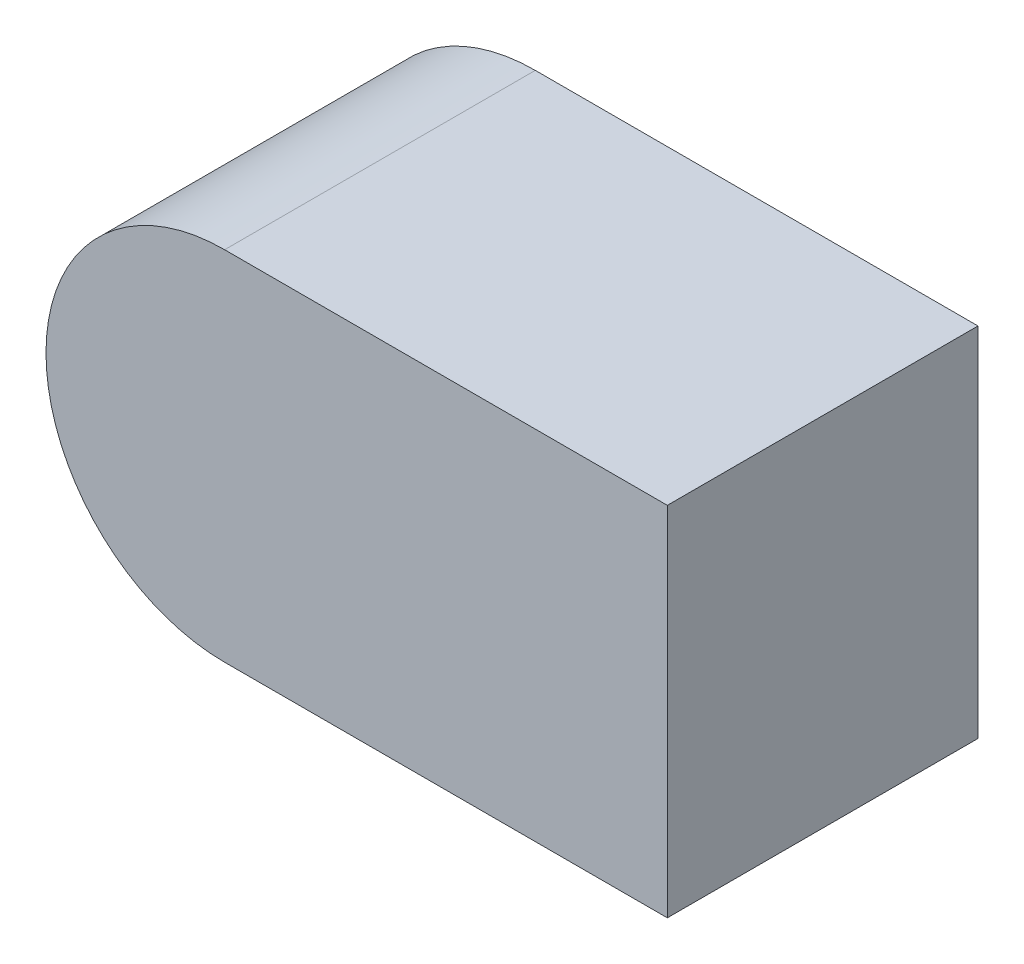
ISO-10303-21;
HEADER;
FILE_DESCRIPTION(('STEP AP214'),'2;1');
FILE_NAME('part.step','',(''),(''),'','','');
FILE_SCHEMA(('AUTOMOTIVE_DESIGN { 1 0 10303 214 1 1 1 1 }'));
ENDSEC;
DATA;
#1=APPLICATION_CONTEXT('core data for automotive mechanical design processes');
#2=APPLICATION_PROTOCOL_DEFINITION('international standard','automotive_design',2000,#1);
#3=PRODUCT_CONTEXT('',#1,'mechanical');
#4=PRODUCT('Part','Part','',(#3));
#5=PRODUCT_RELATED_PRODUCT_CATEGORY('part','',(#4));
#6=PRODUCT_DEFINITION_FORMATION('','',#4);
#7=PRODUCT_DEFINITION_CONTEXT('part definition',#1,'design');
#8=PRODUCT_DEFINITION('design','',#6,#7);
#9=PRODUCT_DEFINITION_SHAPE('','',#8);
#10=(LENGTH_UNIT() NAMED_UNIT(*) SI_UNIT(.MILLI.,.METRE.));
#11=(NAMED_UNIT(*) PLANE_ANGLE_UNIT() SI_UNIT($,.RADIAN.));
#12=(NAMED_UNIT(*) SI_UNIT($,.STERADIAN.) SOLID_ANGLE_UNIT());
#13=UNCERTAINTY_MEASURE_WITH_UNIT(LENGTH_MEASURE(1.E-05),#10,'distance_accuracy_value','');
#14=(GEOMETRIC_REPRESENTATION_CONTEXT(3) GLOBAL_UNCERTAINTY_ASSIGNED_CONTEXT((#13)) GLOBAL_UNIT_ASSIGNED_CONTEXT((#10,
#11,#12)) REPRESENTATION_CONTEXT('',''));
#15=CARTESIAN_POINT('',(0.,0.,0.));
#16=DIRECTION('',(0.,0.,1.));
#17=DIRECTION('',(1.,0.,0.));
#18=AXIS2_PLACEMENT_3D('',#15,#16,#17);
#19=CARTESIAN_POINT('',(2.8335265642716,1.75,0.));
#20=DIRECTION('',(0.,0.,1.));
#21=DIRECTION('',(-1.,0.,0.));
#22=AXIS2_PLACEMENT_3D('',#19,#20,#21);
#23=PLANE('',#22);
#24=DIRECTION('',(0.,1.,0.));
#25=VECTOR('',#24,1.);
#26=CARTESIAN_POINT('',(3.,1.635,0.));
#27=LINE('',#26,#25);
#28=CARTESIAN_POINT('',(3.,1.635,0.));
#29=VERTEX_POINT('',#28);
#30=CARTESIAN_POINT('',(3.,1.865,0.));
#31=VERTEX_POINT('',#30);
#32=EDGE_CURVE('E11',#29,#31,#27,.T.);
#33=ORIENTED_EDGE('',*,*,#32,.F.);
#34=DIRECTION('',(1.,0.,0.));
#35=VECTOR('',#34,1.);
#36=CARTESIAN_POINT('',(2.715,1.635,0.));
#37=LINE('',#36,#35);
#38=CARTESIAN_POINT('',(2.715,1.635,0.));
#39=VERTEX_POINT('',#38);
#40=EDGE_CURVE('E24',#39,#29,#37,.T.);
#41=ORIENTED_EDGE('',*,*,#40,.F.);
#42=CARTESIAN_POINT('',(2.715,1.75,0.));
#43=DIRECTION('',(0.,0.,1.));
#44=DIRECTION('',(0.,1.,0.));
#45=AXIS2_PLACEMENT_3D('',#42,#43,#44);
#46=CIRCLE('',#45,0.115);
#47=CARTESIAN_POINT('',(2.715,1.865,0.));
#48=VERTEX_POINT('',#47);
#49=EDGE_CURVE('E85',#48,#39,#46,.T.);
#50=ORIENTED_EDGE('',*,*,#49,.F.);
#51=DIRECTION('',(-1.,0.,0.));
#52=VECTOR('',#51,1.);
#53=CARTESIAN_POINT('',(3.,1.865,0.));
#54=LINE('',#53,#52);
#55=EDGE_CURVE('E82',#31,#48,#54,.T.);
#56=ORIENTED_EDGE('',*,*,#55,.F.);
#57=EDGE_LOOP('',(#33,#41,#50,#56));
#58=FACE_BOUND('',#57,.T.);
#59=ADVANCED_FACE('F17',(#58),#23,.F.);
#60=CARTESIAN_POINT('',(3.,1.865,0.));
#61=DIRECTION('',(0.,1.,0.));
#62=DIRECTION('',(-1.,0.,0.));
#63=AXIS2_PLACEMENT_3D('',#60,#61,#62);
#64=PLANE('',#63);
#65=ORIENTED_EDGE('',*,*,#55,.T.);
#66=DIRECTION('',(0.,0.,1.));
#67=VECTOR('',#66,1.);
#68=CARTESIAN_POINT('',(2.715,1.865,0.));
#69=LINE('',#68,#67);
#70=CARTESIAN_POINT('',(2.715,1.865,0.2));
#71=VERTEX_POINT('',#70);
#72=EDGE_CURVE('E80',#48,#71,#69,.T.);
#73=ORIENTED_EDGE('',*,*,#72,.T.);
#74=DIRECTION('',(-1.,0.,0.));
#75=VECTOR('',#74,1.);
#76=CARTESIAN_POINT('',(3.,1.865,0.2));
#77=LINE('',#76,#75);
#78=CARTESIAN_POINT('',(3.,1.865,0.2));
#79=VERTEX_POINT('',#78);
#80=EDGE_CURVE('E78',#79,#71,#77,.T.);
#81=ORIENTED_EDGE('',*,*,#80,.F.);
#82=DIRECTION('',(0.,0.,-1.));
#83=VECTOR('',#82,1.);
#84=CARTESIAN_POINT('',(3.,1.865,0.));
#85=LINE('',#84,#83);
#86=EDGE_CURVE('E71',#79,#31,#85,.T.);
#87=ORIENTED_EDGE('',*,*,#86,.T.);
#88=EDGE_LOOP('',(#65,#73,#81,#87));
#89=FACE_BOUND('',#88,.T.);
#90=ADVANCED_FACE('F91',(#89),#64,.T.);
#91=CARTESIAN_POINT('',(2.715,1.75,0.));
#92=DIRECTION('',(0.,0.,1.));
#93=DIRECTION('',(0.,1.,0.));
#94=AXIS2_PLACEMENT_3D('',#91,#92,#93);
#95=CYLINDRICAL_SURFACE('',#94,0.115);
#96=ORIENTED_EDGE('',*,*,#49,.T.);
#97=DIRECTION('',(0.,0.,1.));
#98=VECTOR('',#97,1.);
#99=CARTESIAN_POINT('',(2.715,1.635,0.));
#100=LINE('',#99,#98);
#101=CARTESIAN_POINT('',(2.715,1.635,0.2));
#102=VERTEX_POINT('',#101);
#103=EDGE_CURVE('E75',#39,#102,#100,.T.);
#104=ORIENTED_EDGE('',*,*,#103,.T.);
#105=CARTESIAN_POINT('',(2.715,1.75,0.2));
#106=DIRECTION('',(0.,0.,1.));
#107=DIRECTION('',(0.,1.,0.));
#108=AXIS2_PLACEMENT_3D('',#105,#106,#107);
#109=CIRCLE('',#108,0.115);
#110=EDGE_CURVE('E59',#71,#102,#109,.T.);
#111=ORIENTED_EDGE('',*,*,#110,.F.);
#112=ORIENTED_EDGE('',*,*,#72,.F.);
#113=EDGE_LOOP('',(#96,#104,#111,#112));
#114=FACE_BOUND('',#113,.T.);
#115=ADVANCED_FACE('F89',(#114),#95,.T.);
#116=CARTESIAN_POINT('',(2.715,1.635,0.));
#117=DIRECTION('',(0.,-1.,0.));
#118=DIRECTION('',(1.,0.,0.));
#119=AXIS2_PLACEMENT_3D('',#116,#117,#118);
#120=PLANE('',#119);
#121=ORIENTED_EDGE('',*,*,#40,.T.);
#122=DIRECTION('',(0.,0.,1.));
#123=VECTOR('',#122,1.);
#124=CARTESIAN_POINT('',(3.,1.635,0.));
#125=LINE('',#124,#123);
#126=CARTESIAN_POINT('',(3.,1.635,0.2));
#127=VERTEX_POINT('',#126);
#128=EDGE_CURVE('E53',#29,#127,#125,.T.);
#129=ORIENTED_EDGE('',*,*,#128,.T.);
#130=DIRECTION('',(1.,0.,0.));
#131=VECTOR('',#130,1.);
#132=CARTESIAN_POINT('',(2.715,1.635,0.2));
#133=LINE('',#132,#131);
#134=EDGE_CURVE('E57',#102,#127,#133,.T.);
#135=ORIENTED_EDGE('',*,*,#134,.F.);
#136=ORIENTED_EDGE('',*,*,#103,.F.);
#137=EDGE_LOOP('',(#121,#129,#135,#136));
#138=FACE_BOUND('',#137,.T.);
#139=ADVANCED_FACE('F55',(#138),#120,.T.);
#140=CARTESIAN_POINT('',(3.,-3.,0.));
#141=DIRECTION('',(1.,0.,0.));
#142=DIRECTION('',(0.,1.,0.));
#143=AXIS2_PLACEMENT_3D('',#140,#141,#142);
#144=PLANE('',#143);
#145=ORIENTED_EDGE('',*,*,#86,.F.);
#146=DIRECTION('',(0.,1.,0.));
#147=VECTOR('',#146,1.);
#148=CARTESIAN_POINT('',(3.,-0.625000000000001,0.2));
#149=LINE('',#148,#147);
#150=EDGE_CURVE('E66',#127,#79,#149,.T.);
#151=ORIENTED_EDGE('',*,*,#150,.F.);
#152=ORIENTED_EDGE('',*,*,#128,.F.);
#153=ORIENTED_EDGE('',*,*,#32,.T.);
#154=EDGE_LOOP('',(#145,#151,#152,#153));
#155=FACE_BOUND('',#154,.T.);
#156=ADVANCED_FACE('F69',(#155),#144,.T.);
#157=CARTESIAN_POINT('',(2.8335240809167,1.75,0.2));
#158=DIRECTION('',(0.,0.,1.));
#159=DIRECTION('',(1.,0.,0.));
#160=AXIS2_PLACEMENT_3D('',#157,#158,#159);
#161=PLANE('',#160);
#162=ORIENTED_EDGE('',*,*,#134,.T.);
#163=ORIENTED_EDGE('',*,*,#150,.T.);
#164=ORIENTED_EDGE('',*,*,#80,.T.);
#165=ORIENTED_EDGE('',*,*,#110,.T.);
#166=EDGE_LOOP('',(#162,#163,#164,#165));
#167=FACE_BOUND('',#166,.T.);
#168=ADVANCED_FACE('F64',(#167),#161,.T.);
#169=CLOSED_SHELL('',(#59,#90,#115,#139,#156,#168));
#170=MANIFOLD_SOLID_BREP('B1',#169);
#171=ADVANCED_BREP_SHAPE_REPRESENTATION('',(#18,#170),#14);
#172=SHAPE_DEFINITION_REPRESENTATION(#9,#171);
ENDSEC;
END-ISO-10303-21;
